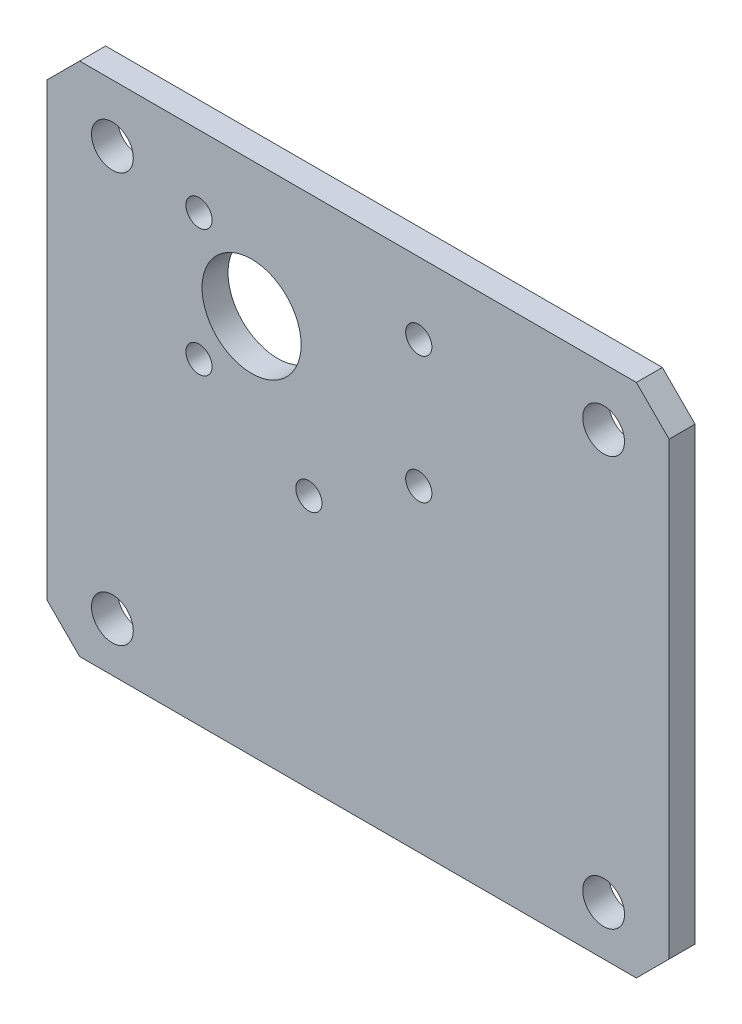
ISO-10303-21;
HEADER;
FILE_DESCRIPTION(('STEP AP214'),'2;1');
FILE_NAME('part.step','',(''),(''),'','','');
FILE_SCHEMA(('AUTOMOTIVE_DESIGN { 1 0 10303 214 1 1 1 1 }'));
ENDSEC;
DATA;
#1=APPLICATION_CONTEXT('core data for automotive mechanical design processes');
#2=APPLICATION_PROTOCOL_DEFINITION('international standard','automotive_design',2000,#1);
#3=PRODUCT_CONTEXT('',#1,'mechanical');
#4=PRODUCT('Part','Part','',(#3));
#5=PRODUCT_RELATED_PRODUCT_CATEGORY('part','',(#4));
#6=PRODUCT_DEFINITION_FORMATION('','',#4);
#7=PRODUCT_DEFINITION_CONTEXT('part definition',#1,'design');
#8=PRODUCT_DEFINITION('design','',#6,#7);
#9=PRODUCT_DEFINITION_SHAPE('','',#8);
#10=(LENGTH_UNIT() NAMED_UNIT(*) SI_UNIT(.MILLI.,.METRE.));
#11=(NAMED_UNIT(*) PLANE_ANGLE_UNIT() SI_UNIT($,.RADIAN.));
#12=(NAMED_UNIT(*) SI_UNIT($,.STERADIAN.) SOLID_ANGLE_UNIT());
#13=UNCERTAINTY_MEASURE_WITH_UNIT(LENGTH_MEASURE(1.E-05),#10,'distance_accuracy_value','');
#14=(GEOMETRIC_REPRESENTATION_CONTEXT(3) GLOBAL_UNCERTAINTY_ASSIGNED_CONTEXT((#13)) GLOBAL_UNIT_ASSIGNED_CONTEXT((#10,
#11,#12)) REPRESENTATION_CONTEXT('',''));
#15=CARTESIAN_POINT('',(0.,0.,0.));
#16=DIRECTION('',(0.,0.,1.));
#17=DIRECTION('',(1.,0.,0.));
#18=AXIS2_PLACEMENT_3D('',#15,#16,#17);
#19=CARTESIAN_POINT('',(0.,0.,3.175));
#20=DIRECTION('',(0.,0.,1.));
#21=DIRECTION('',(1.,0.,0.));
#22=AXIS2_PLACEMENT_3D('',#19,#20,#21);
#23=PLANE('',#22);
#24=CARTESIAN_POINT('',(-24.,9.50000001000001,3.175));
#25=DIRECTION('',(0.,0.,1.));
#26=DIRECTION('',(1.,0.,0.));
#27=AXIS2_PLACEMENT_3D('',#24,#25,#26);
#28=CIRCLE('',#27,2.55269999999999);
#29=CARTESIAN_POINT('',(-21.4473,9.50000001000001,3.175));
#30=VERTEX_POINT('',#29);
#31=EDGE_CURVE('E228',#30,#30,#28,.T.);
#32=ORIENTED_EDGE('',*,*,#31,.F.);
#33=EDGE_LOOP('',(#32));
#34=FACE_BOUND('',#33,.T.);
#35=CARTESIAN_POINT('',(36.,9.50000001000001,3.175));
#36=DIRECTION('',(0.,0.,1.));
#37=DIRECTION('',(1.,0.,0.));
#38=AXIS2_PLACEMENT_3D('',#35,#36,#37);
#39=CIRCLE('',#38,2.55269999999999);
#40=CARTESIAN_POINT('',(38.5527,9.50000001000001,3.175));
#41=VERTEX_POINT('',#40);
#42=EDGE_CURVE('E222',#41,#41,#39,.T.);
#43=ORIENTED_EDGE('',*,*,#42,.F.);
#44=EDGE_LOOP('',(#43));
#45=FACE_BOUND('',#44,.T.);
#46=CARTESIAN_POINT('',(36.,-40.49999999,3.175));
#47=DIRECTION('',(0.,0.,1.));
#48=DIRECTION('',(1.,0.,0.));
#49=AXIS2_PLACEMENT_3D('',#46,#47,#48);
#50=CIRCLE('',#49,2.55269999999999);
#51=CARTESIAN_POINT('',(38.5527,-40.49999999,3.175));
#52=VERTEX_POINT('',#51);
#53=EDGE_CURVE('E216',#52,#52,#50,.T.);
#54=ORIENTED_EDGE('',*,*,#53,.F.);
#55=EDGE_LOOP('',(#54));
#56=FACE_BOUND('',#55,.T.);
#57=CARTESIAN_POINT('',(-24.,-40.49999999,3.175));
#58=DIRECTION('',(0.,0.,1.));
#59=DIRECTION('',(1.,0.,0.));
#60=AXIS2_PLACEMENT_3D('',#57,#58,#59);
#61=CIRCLE('',#60,2.55269999999999);
#62=CARTESIAN_POINT('',(-21.4473,-40.49999999,3.175));
#63=VERTEX_POINT('',#62);
#64=EDGE_CURVE('E210',#63,#63,#61,.T.);
#65=ORIENTED_EDGE('',*,*,#64,.F.);
#66=EDGE_LOOP('',(#65));
#67=FACE_BOUND('',#66,.T.);
#68=CARTESIAN_POINT('',(13.4233937586589,-7.74999999999988,3.175));
#69=DIRECTION('',(0.,0.,1.));
#70=DIRECTION('',(1.,0.,0.));
#71=AXIS2_PLACEMENT_3D('',#68,#69,#70);
#72=CIRCLE('',#71,1.6);
#73=CARTESIAN_POINT('',(15.0233937586589,-7.74999999999988,3.175));
#74=VERTEX_POINT('',#73);
#75=EDGE_CURVE('E193',#74,#74,#72,.T.);
#76=ORIENTED_EDGE('',*,*,#75,.F.);
#77=EDGE_LOOP('',(#76));
#78=FACE_BOUND('',#77,.T.);
#79=CARTESIAN_POINT('',(-13.4233937586588,-7.75000000000006,3.175));
#80=DIRECTION('',(0.,0.,1.));
#81=DIRECTION('',(1.,0.,0.));
#82=AXIS2_PLACEMENT_3D('',#79,#80,#81);
#83=CIRCLE('',#82,1.6);
#84=CARTESIAN_POINT('',(-11.8233937586588,-7.75000000000006,3.175));
#85=VERTEX_POINT('',#84);
#86=EDGE_CURVE('E181',#85,#85,#83,.T.);
#87=ORIENTED_EDGE('',*,*,#86,.F.);
#88=EDGE_LOOP('',(#87));
#89=FACE_BOUND('',#88,.T.);
#90=CARTESIAN_POINT('',(-6.99999999999999,0.,3.175));
#91=DIRECTION('',(0.,0.,1.));
#92=DIRECTION('',(1.,0.,0.));
#93=AXIS2_PLACEMENT_3D('',#90,#91,#92);
#94=CIRCLE('',#93,6.05);
#95=CARTESIAN_POINT('',(-0.949999999999993,0.,3.175));
#96=VERTEX_POINT('',#95);
#97=EDGE_CURVE('E164',#96,#96,#94,.T.);
#98=ORIENTED_EDGE('',*,*,#97,.F.);
#99=EDGE_LOOP('',(#98));
#100=FACE_BOUND('',#99,.T.);
#101=DIRECTION('',(1.,0.,0.));
#102=VECTOR('',#101,1.);
#103=CARTESIAN_POINT('',(-32.,-46.4999999899999,3.175));
#104=LINE('',#103,#102);
#105=CARTESIAN_POINT('',(-28.,-46.4999999899999,3.175));
#106=VERTEX_POINT('',#105);
#107=CARTESIAN_POINT('',(40.,-46.4999999899999,3.175));
#108=VERTEX_POINT('',#107);
#109=EDGE_CURVE('E171',#106,#108,#104,.T.);
#110=ORIENTED_EDGE('',*,*,#109,.T.);
#111=DIRECTION('',(-0.707106781186549,-0.707106781186546,0.));
#112=VECTOR('',#111,1.);
#113=CARTESIAN_POINT('',(43.2499999949999,-43.249999995,3.175));
#114=LINE('',#113,#112);
#115=CARTESIAN_POINT('',(44.,-42.4999999899999,3.175));
#116=VERTEX_POINT('',#115);
#117=EDGE_CURVE('E148',#108,#116,#114,.F.);
#118=ORIENTED_EDGE('',*,*,#117,.T.);
#119=DIRECTION('',(0.,1.,0.));
#120=VECTOR('',#119,1.);
#121=CARTESIAN_POINT('',(44.,16.5000000100001,3.175));
#122=LINE('',#121,#120);
#123=CARTESIAN_POINT('',(44.,12.50000001,3.175));
#124=VERTEX_POINT('',#123);
#125=EDGE_CURVE('E118',#116,#124,#122,.T.);
#126=ORIENTED_EDGE('',*,*,#125,.T.);
#127=DIRECTION('',(0.707106781186545,-0.70710678118655,0.));
#128=VECTOR('',#127,1.);
#129=CARTESIAN_POINT('',(28.2500000050002,28.250000005,3.175));
#130=LINE('',#129,#128);
#131=CARTESIAN_POINT('',(40.,16.5000000100001,3.175));
#132=VERTEX_POINT('',#131);
#133=EDGE_CURVE('E55',#124,#132,#130,.F.);
#134=ORIENTED_EDGE('',*,*,#133,.T.);
#135=DIRECTION('',(-1.,0.,0.));
#136=VECTOR('',#135,1.);
#137=CARTESIAN_POINT('',(-32.,16.5000000100001,3.175));
#138=LINE('',#137,#136);
#139=CARTESIAN_POINT('',(-28.,16.5000000100001,3.175));
#140=VERTEX_POINT('',#139);
#141=EDGE_CURVE('E134',#132,#140,#138,.T.);
#142=ORIENTED_EDGE('',*,*,#141,.T.);
#143=DIRECTION('',(0.707106781186549,0.707106781186546,0.));
#144=VECTOR('',#143,1.);
#145=CARTESIAN_POINT('',(-22.250000005,22.250000005,3.175));
#146=LINE('',#145,#144);
#147=CARTESIAN_POINT('',(-32.,12.5000000100001,3.175));
#148=VERTEX_POINT('',#147);
#149=EDGE_CURVE('E143',#140,#148,#146,.F.);
#150=ORIENTED_EDGE('',*,*,#149,.T.);
#151=DIRECTION('',(0.,-1.,0.));
#152=VECTOR('',#151,1.);
#153=CARTESIAN_POINT('',(-32.,16.5000000100001,3.175));
#154=LINE('',#153,#152);
#155=CARTESIAN_POINT('',(-32.,-42.4999999899999,3.175));
#156=VERTEX_POINT('',#155);
#157=EDGE_CURVE('E128',#148,#156,#154,.T.);
#158=ORIENTED_EDGE('',*,*,#157,.T.);
#159=DIRECTION('',(-0.707106781186545,0.70710678118655,0.));
#160=VECTOR('',#159,1.);
#161=CARTESIAN_POINT('',(-37.249999995,-37.2499999949998,3.175));
#162=LINE('',#161,#160);
#163=EDGE_CURVE('E145',#156,#106,#162,.F.);
#164=ORIENTED_EDGE('',*,*,#163,.T.);
#165=EDGE_LOOP('',(#110,#118,#126,#134,#142,#150,#158,#164));
#166=FACE_BOUND('',#165,.T.);
#167=CARTESIAN_POINT('',(-13.4233937586588,7.74999999999997,3.175));
#168=DIRECTION('',(0.,0.,1.));
#169=DIRECTION('',(1.,0.,0.));
#170=AXIS2_PLACEMENT_3D('',#167,#168,#169);
#171=CIRCLE('',#170,1.6);
#172=CARTESIAN_POINT('',(-11.8233937586588,7.74999999999997,3.175));
#173=VERTEX_POINT('',#172);
#174=EDGE_CURVE('E176',#173,#173,#171,.T.);
#175=ORIENTED_EDGE('',*,*,#174,.F.);
#176=EDGE_LOOP('',(#175));
#177=FACE_BOUND('',#176,.T.);
#178=CARTESIAN_POINT('',(0.,-15.5,3.175));
#179=DIRECTION('',(0.,0.,1.));
#180=DIRECTION('',(1.,0.,0.));
#181=AXIS2_PLACEMENT_3D('',#178,#179,#180);
#182=CIRCLE('',#181,1.6);
#183=CARTESIAN_POINT('',(1.6,-15.5,3.175));
#184=VERTEX_POINT('',#183);
#185=EDGE_CURVE('E187',#184,#184,#182,.T.);
#186=ORIENTED_EDGE('',*,*,#185,.F.);
#187=EDGE_LOOP('',(#186));
#188=FACE_BOUND('',#187,.T.);
#189=CARTESIAN_POINT('',(13.4233937586587,7.75000000000016,3.175));
#190=DIRECTION('',(0.,0.,1.));
#191=DIRECTION('',(1.,0.,0.));
#192=AXIS2_PLACEMENT_3D('',#189,#190,#191);
#193=CIRCLE('',#192,1.6);
#194=CARTESIAN_POINT('',(15.0233937586587,7.75000000000016,3.175));
#195=VERTEX_POINT('',#194);
#196=EDGE_CURVE('E199',#195,#195,#193,.T.);
#197=ORIENTED_EDGE('',*,*,#196,.F.);
#198=EDGE_LOOP('',(#197));
#199=FACE_BOUND('',#198,.T.);
#200=ADVANCED_FACE('F33',(#34,#45,#56,#67,#78,#89,#100,#166,#177,#188,#199),#23,.T.);
#201=CARTESIAN_POINT('',(0.,0.,0.));
#202=DIRECTION('',(0.,0.,1.));
#203=DIRECTION('',(1.,0.,0.));
#204=AXIS2_PLACEMENT_3D('',#201,#202,#203);
#205=PLANE('',#204);
#206=CARTESIAN_POINT('',(-24.,9.50000001000001,0.));
#207=DIRECTION('',(0.,0.,1.));
#208=DIRECTION('',(1.,0.,0.));
#209=AXIS2_PLACEMENT_3D('',#206,#207,#208);
#210=CIRCLE('',#209,2.5527);
#211=CARTESIAN_POINT('',(-21.4473,9.50000001000001,0.));
#212=VERTEX_POINT('',#211);
#213=EDGE_CURVE('E225',#212,#212,#210,.T.);
#214=ORIENTED_EDGE('',*,*,#213,.T.);
#215=EDGE_LOOP('',(#214));
#216=FACE_BOUND('',#215,.T.);
#217=CARTESIAN_POINT('',(36.,9.50000001000001,0.));
#218=DIRECTION('',(0.,0.,1.));
#219=DIRECTION('',(1.,0.,0.));
#220=AXIS2_PLACEMENT_3D('',#217,#218,#219);
#221=CIRCLE('',#220,2.5527);
#222=CARTESIAN_POINT('',(38.5527,9.50000001000001,0.));
#223=VERTEX_POINT('',#222);
#224=EDGE_CURVE('E219',#223,#223,#221,.T.);
#225=ORIENTED_EDGE('',*,*,#224,.T.);
#226=EDGE_LOOP('',(#225));
#227=FACE_BOUND('',#226,.T.);
#228=CARTESIAN_POINT('',(36.,-40.49999999,0.));
#229=DIRECTION('',(0.,0.,1.));
#230=DIRECTION('',(1.,0.,0.));
#231=AXIS2_PLACEMENT_3D('',#228,#229,#230);
#232=CIRCLE('',#231,2.5527);
#233=CARTESIAN_POINT('',(38.5527,-40.49999999,0.));
#234=VERTEX_POINT('',#233);
#235=EDGE_CURVE('E213',#234,#234,#232,.T.);
#236=ORIENTED_EDGE('',*,*,#235,.T.);
#237=EDGE_LOOP('',(#236));
#238=FACE_BOUND('',#237,.T.);
#239=CARTESIAN_POINT('',(-24.,-40.49999999,0.));
#240=DIRECTION('',(0.,0.,1.));
#241=DIRECTION('',(1.,0.,0.));
#242=AXIS2_PLACEMENT_3D('',#239,#240,#241);
#243=CIRCLE('',#242,2.5527);
#244=CARTESIAN_POINT('',(-21.4473,-40.49999999,0.));
#245=VERTEX_POINT('',#244);
#246=EDGE_CURVE('E205',#245,#245,#243,.T.);
#247=ORIENTED_EDGE('',*,*,#246,.T.);
#248=EDGE_LOOP('',(#247));
#249=FACE_BOUND('',#248,.T.);
#250=DIRECTION('',(0.,1.,0.));
#251=VECTOR('',#250,1.);
#252=CARTESIAN_POINT('',(44.,16.5000000100001,0.));
#253=LINE('',#252,#251);
#254=CARTESIAN_POINT('',(44.,-42.4999999899999,0.));
#255=VERTEX_POINT('',#254);
#256=CARTESIAN_POINT('',(44.,12.50000001,0.));
#257=VERTEX_POINT('',#256);
#258=EDGE_CURVE('E116',#255,#257,#253,.T.);
#259=ORIENTED_EDGE('',*,*,#258,.F.);
#260=DIRECTION('',(0.707106781186549,0.707106781186546,0.));
#261=VECTOR('',#260,1.);
#262=CARTESIAN_POINT('',(44.,-42.4999999899999,0.));
#263=LINE('',#262,#261);
#264=CARTESIAN_POINT('',(40.,-46.4999999899999,0.));
#265=VERTEX_POINT('',#264);
#266=EDGE_CURVE('E99',#255,#265,#263,.F.);
#267=ORIENTED_EDGE('',*,*,#266,.T.);
#268=DIRECTION('',(1.,0.,0.));
#269=VECTOR('',#268,1.);
#270=CARTESIAN_POINT('',(-32.,-46.4999999899999,0.));
#271=LINE('',#270,#269);
#272=CARTESIAN_POINT('',(-28.,-46.4999999899999,0.));
#273=VERTEX_POINT('',#272);
#274=EDGE_CURVE('E126',#273,#265,#271,.T.);
#275=ORIENTED_EDGE('',*,*,#274,.F.);
#276=DIRECTION('',(0.707106781186545,-0.70710678118655,0.));
#277=VECTOR('',#276,1.);
#278=CARTESIAN_POINT('',(-28.,-46.4999999899999,0.));
#279=LINE('',#278,#277);
#280=CARTESIAN_POINT('',(-32.,-42.4999999899999,0.));
#281=VERTEX_POINT('',#280);
#282=EDGE_CURVE('E137',#273,#281,#279,.F.);
#283=ORIENTED_EDGE('',*,*,#282,.T.);
#284=DIRECTION('',(0.,-1.,0.));
#285=VECTOR('',#284,1.);
#286=CARTESIAN_POINT('',(-32.,16.5000000100001,0.));
#287=LINE('',#286,#285);
#288=CARTESIAN_POINT('',(-32.,12.5000000100001,0.));
#289=VERTEX_POINT('',#288);
#290=EDGE_CURVE('E130',#289,#281,#287,.T.);
#291=ORIENTED_EDGE('',*,*,#290,.F.);
#292=DIRECTION('',(-0.707106781186549,-0.707106781186546,0.));
#293=VECTOR('',#292,1.);
#294=CARTESIAN_POINT('',(-32.,12.5000000100001,0.));
#295=LINE('',#294,#293);
#296=CARTESIAN_POINT('',(-28.,16.5000000100001,0.));
#297=VERTEX_POINT('',#296);
#298=EDGE_CURVE('E119',#289,#297,#295,.F.);
#299=ORIENTED_EDGE('',*,*,#298,.T.);
#300=DIRECTION('',(-1.,0.,0.));
#301=VECTOR('',#300,1.);
#302=CARTESIAN_POINT('',(-32.,16.5000000100001,0.));
#303=LINE('',#302,#301);
#304=CARTESIAN_POINT('',(40.,16.5000000100001,0.));
#305=VERTEX_POINT('',#304);
#306=EDGE_CURVE('E125',#305,#297,#303,.T.);
#307=ORIENTED_EDGE('',*,*,#306,.F.);
#308=DIRECTION('',(-0.707106781186545,0.70710678118655,0.));
#309=VECTOR('',#308,1.);
#310=CARTESIAN_POINT('',(40.,16.5000000100001,0.));
#311=LINE('',#310,#309);
#312=EDGE_CURVE('E110',#305,#257,#311,.F.);
#313=ORIENTED_EDGE('',*,*,#312,.T.);
#314=EDGE_LOOP('',(#259,#267,#275,#283,#291,#299,#307,#313));
#315=FACE_BOUND('',#314,.T.);
#316=CARTESIAN_POINT('',(-6.99999999999999,0.,0.));
#317=DIRECTION('',(0.,0.,1.));
#318=DIRECTION('',(1.,0.,0.));
#319=AXIS2_PLACEMENT_3D('',#316,#317,#318);
#320=CIRCLE('',#319,6.05);
#321=CARTESIAN_POINT('',(-0.949999999999993,0.,0.));
#322=VERTEX_POINT('',#321);
#323=EDGE_CURVE('E166',#322,#322,#320,.T.);
#324=ORIENTED_EDGE('',*,*,#323,.T.);
#325=EDGE_LOOP('',(#324));
#326=FACE_BOUND('',#325,.T.);
#327=CARTESIAN_POINT('',(-13.4233937586588,7.74999999999997,0.));
#328=DIRECTION('',(0.,0.,1.));
#329=DIRECTION('',(1.,0.,0.));
#330=AXIS2_PLACEMENT_3D('',#327,#328,#329);
#331=CIRCLE('',#330,1.6);
#332=CARTESIAN_POINT('',(-11.8233937586588,7.74999999999997,0.));
#333=VERTEX_POINT('',#332);
#334=EDGE_CURVE('E178',#333,#333,#331,.T.);
#335=ORIENTED_EDGE('',*,*,#334,.T.);
#336=EDGE_LOOP('',(#335));
#337=FACE_BOUND('',#336,.T.);
#338=CARTESIAN_POINT('',(-13.4233937586588,-7.75000000000006,0.));
#339=DIRECTION('',(0.,0.,1.));
#340=DIRECTION('',(1.,0.,0.));
#341=AXIS2_PLACEMENT_3D('',#338,#339,#340);
#342=CIRCLE('',#341,1.6);
#343=CARTESIAN_POINT('',(-11.8233937586588,-7.75000000000006,0.));
#344=VERTEX_POINT('',#343);
#345=EDGE_CURVE('E184',#344,#344,#342,.T.);
#346=ORIENTED_EDGE('',*,*,#345,.T.);
#347=EDGE_LOOP('',(#346));
#348=FACE_BOUND('',#347,.T.);
#349=CARTESIAN_POINT('',(0.,-15.5,0.));
#350=DIRECTION('',(0.,0.,1.));
#351=DIRECTION('',(1.,0.,0.));
#352=AXIS2_PLACEMENT_3D('',#349,#350,#351);
#353=CIRCLE('',#352,1.6);
#354=CARTESIAN_POINT('',(1.6,-15.5,0.));
#355=VERTEX_POINT('',#354);
#356=EDGE_CURVE('E190',#355,#355,#353,.T.);
#357=ORIENTED_EDGE('',*,*,#356,.T.);
#358=EDGE_LOOP('',(#357));
#359=FACE_BOUND('',#358,.T.);
#360=CARTESIAN_POINT('',(13.4233937586589,-7.74999999999988,0.));
#361=DIRECTION('',(0.,0.,1.));
#362=DIRECTION('',(1.,0.,0.));
#363=AXIS2_PLACEMENT_3D('',#360,#361,#362);
#364=CIRCLE('',#363,1.6);
#365=CARTESIAN_POINT('',(15.0233937586589,-7.74999999999988,0.));
#366=VERTEX_POINT('',#365);
#367=EDGE_CURVE('E196',#366,#366,#364,.T.);
#368=ORIENTED_EDGE('',*,*,#367,.T.);
#369=EDGE_LOOP('',(#368));
#370=FACE_BOUND('',#369,.T.);
#371=CARTESIAN_POINT('',(13.4233937586587,7.75000000000016,0.));
#372=DIRECTION('',(0.,0.,1.));
#373=DIRECTION('',(1.,0.,0.));
#374=AXIS2_PLACEMENT_3D('',#371,#372,#373);
#375=CIRCLE('',#374,1.6);
#376=CARTESIAN_POINT('',(15.0233937586587,7.75000000000016,0.));
#377=VERTEX_POINT('',#376);
#378=EDGE_CURVE('E202',#377,#377,#375,.T.);
#379=ORIENTED_EDGE('',*,*,#378,.T.);
#380=EDGE_LOOP('',(#379));
#381=FACE_BOUND('',#380,.T.);
#382=ADVANCED_FACE('F122',(#216,#227,#238,#249,#315,#326,#337,#348,#359,#370,#381),#205,.F.);
#383=CARTESIAN_POINT('',(-32.,16.5000000100001,3.175));
#384=DIRECTION('',(1.,0.,0.));
#385=DIRECTION('',(0.,1.,0.));
#386=AXIS2_PLACEMENT_3D('',#383,#384,#385);
#387=PLANE('',#386);
#388=ORIENTED_EDGE('',*,*,#290,.T.);
#389=DIRECTION('',(0.,0.,1.));
#390=VECTOR('',#389,1.);
#391=CARTESIAN_POINT('',(-32.,-42.4999999899999,3.175));
#392=LINE('',#391,#390);
#393=EDGE_CURVE('E11',#281,#156,#392,.T.);
#394=ORIENTED_EDGE('',*,*,#393,.T.);
#395=ORIENTED_EDGE('',*,*,#157,.F.);
#396=DIRECTION('',(0.,0.,-1.));
#397=VECTOR('',#396,1.);
#398=CARTESIAN_POINT('',(-32.,12.5000000100001,3.175));
#399=LINE('',#398,#397);
#400=EDGE_CURVE('E41',#148,#289,#399,.T.);
#401=ORIENTED_EDGE('',*,*,#400,.T.);
#402=EDGE_LOOP('',(#388,#394,#395,#401));
#403=FACE_BOUND('',#402,.T.);
#404=ADVANCED_FACE('F159',(#403),#387,.F.);
#405=CARTESIAN_POINT('',(-32.,-46.4999999899999,3.175));
#406=DIRECTION('',(0.,1.,0.));
#407=DIRECTION('',(0.,0.,1.));
#408=AXIS2_PLACEMENT_3D('',#405,#406,#407);
#409=PLANE('',#408);
#410=ORIENTED_EDGE('',*,*,#274,.T.);
#411=DIRECTION('',(0.,0.,1.));
#412=VECTOR('',#411,1.);
#413=CARTESIAN_POINT('',(40.,-46.4999999899999,3.175));
#414=LINE('',#413,#412);
#415=EDGE_CURVE('E104',#265,#108,#414,.T.);
#416=ORIENTED_EDGE('',*,*,#415,.T.);
#417=ORIENTED_EDGE('',*,*,#109,.F.);
#418=DIRECTION('',(0.,0.,-1.));
#419=VECTOR('',#418,1.);
#420=CARTESIAN_POINT('',(-28.,-46.4999999899999,3.175));
#421=LINE('',#420,#419);
#422=EDGE_CURVE('E109',#106,#273,#421,.T.);
#423=ORIENTED_EDGE('',*,*,#422,.T.);
#424=EDGE_LOOP('',(#410,#416,#417,#423));
#425=FACE_BOUND('',#424,.T.);
#426=ADVANCED_FACE('F269',(#425),#409,.F.);
#427=CARTESIAN_POINT('',(44.,16.5000000100001,3.175));
#428=DIRECTION('',(-1.,0.,0.));
#429=DIRECTION('',(0.,-1.,0.));
#430=AXIS2_PLACEMENT_3D('',#427,#428,#429);
#431=PLANE('',#430);
#432=ORIENTED_EDGE('',*,*,#125,.F.);
#433=DIRECTION('',(0.,0.,-1.));
#434=VECTOR('',#433,1.);
#435=CARTESIAN_POINT('',(44.,-42.4999999899999,3.175));
#436=LINE('',#435,#434);
#437=EDGE_CURVE('E103',#116,#255,#436,.T.);
#438=ORIENTED_EDGE('',*,*,#437,.T.);
#439=ORIENTED_EDGE('',*,*,#258,.T.);
#440=DIRECTION('',(0.,0.,1.));
#441=VECTOR('',#440,1.);
#442=CARTESIAN_POINT('',(44.,12.50000001,3.175));
#443=LINE('',#442,#441);
#444=EDGE_CURVE('E120',#257,#124,#443,.T.);
#445=ORIENTED_EDGE('',*,*,#444,.T.);
#446=EDGE_LOOP('',(#432,#438,#439,#445));
#447=FACE_BOUND('',#446,.T.);
#448=ADVANCED_FACE('F115',(#447),#431,.F.);
#449=CARTESIAN_POINT('',(-32.,16.5000000100001,3.175));
#450=DIRECTION('',(0.,-1.,0.));
#451=DIRECTION('',(0.,0.,-1.));
#452=AXIS2_PLACEMENT_3D('',#449,#450,#451);
#453=PLANE('',#452);
#454=ORIENTED_EDGE('',*,*,#141,.F.);
#455=DIRECTION('',(0.,0.,-1.));
#456=VECTOR('',#455,1.);
#457=CARTESIAN_POINT('',(40.,16.5000000100001,3.175));
#458=LINE('',#457,#456);
#459=EDGE_CURVE('E151',#132,#305,#458,.T.);
#460=ORIENTED_EDGE('',*,*,#459,.T.);
#461=ORIENTED_EDGE('',*,*,#306,.T.);
#462=DIRECTION('',(0.,0.,1.));
#463=VECTOR('',#462,1.);
#464=CARTESIAN_POINT('',(-28.,16.5000000100001,3.175));
#465=LINE('',#464,#463);
#466=EDGE_CURVE('E48',#297,#140,#465,.T.);
#467=ORIENTED_EDGE('',*,*,#466,.T.);
#468=EDGE_LOOP('',(#454,#460,#461,#467));
#469=FACE_BOUND('',#468,.T.);
#470=ADVANCED_FACE('F274',(#469),#453,.F.);
#471=CARTESIAN_POINT('',(-6.99999999999999,0.,3.175));
#472=DIRECTION('',(0.,0.,-1.));
#473=DIRECTION('',(-1.,0.,0.));
#474=AXIS2_PLACEMENT_3D('',#471,#472,#473);
#475=CYLINDRICAL_SURFACE('',#474,6.05);
#476=ORIENTED_EDGE('',*,*,#97,.T.);
#477=EDGE_LOOP('',(#476));
#478=FACE_BOUND('',#477,.T.);
#479=ORIENTED_EDGE('',*,*,#323,.F.);
#480=EDGE_LOOP('',(#479));
#481=FACE_BOUND('',#480,.T.);
#482=ADVANCED_FACE('F277',(#478,#481),#475,.F.);
#483=CARTESIAN_POINT('',(-13.4233937586588,7.74999999999997,3.175));
#484=DIRECTION('',(0.,0.,-1.));
#485=DIRECTION('',(-1.,0.,0.));
#486=AXIS2_PLACEMENT_3D('',#483,#484,#485);
#487=CYLINDRICAL_SURFACE('',#486,1.6);
#488=ORIENTED_EDGE('',*,*,#174,.T.);
#489=EDGE_LOOP('',(#488));
#490=FACE_BOUND('',#489,.T.);
#491=ORIENTED_EDGE('',*,*,#334,.F.);
#492=EDGE_LOOP('',(#491));
#493=FACE_BOUND('',#492,.T.);
#494=ADVANCED_FACE('F324',(#490,#493),#487,.F.);
#495=CARTESIAN_POINT('',(-13.4233937586588,-7.75000000000006,3.175));
#496=DIRECTION('',(0.,0.,-1.));
#497=DIRECTION('',(-1.,0.,0.));
#498=AXIS2_PLACEMENT_3D('',#495,#496,#497);
#499=CYLINDRICAL_SURFACE('',#498,1.6);
#500=ORIENTED_EDGE('',*,*,#86,.T.);
#501=EDGE_LOOP('',(#500));
#502=FACE_BOUND('',#501,.T.);
#503=ORIENTED_EDGE('',*,*,#345,.F.);
#504=EDGE_LOOP('',(#503));
#505=FACE_BOUND('',#504,.T.);
#506=ADVANCED_FACE('F320',(#502,#505),#499,.F.);
#507=CARTESIAN_POINT('',(0.,-15.5,3.175));
#508=DIRECTION('',(0.,0.,-1.));
#509=DIRECTION('',(-1.,0.,0.));
#510=AXIS2_PLACEMENT_3D('',#507,#508,#509);
#511=CYLINDRICAL_SURFACE('',#510,1.6);
#512=ORIENTED_EDGE('',*,*,#185,.T.);
#513=EDGE_LOOP('',(#512));
#514=FACE_BOUND('',#513,.T.);
#515=ORIENTED_EDGE('',*,*,#356,.F.);
#516=EDGE_LOOP('',(#515));
#517=FACE_BOUND('',#516,.T.);
#518=ADVANCED_FACE('F316',(#514,#517),#511,.F.);
#519=CARTESIAN_POINT('',(13.4233937586589,-7.74999999999988,3.175));
#520=DIRECTION('',(0.,0.,-1.));
#521=DIRECTION('',(-1.,0.,0.));
#522=AXIS2_PLACEMENT_3D('',#519,#520,#521);
#523=CYLINDRICAL_SURFACE('',#522,1.6);
#524=ORIENTED_EDGE('',*,*,#75,.T.);
#525=EDGE_LOOP('',(#524));
#526=FACE_BOUND('',#525,.T.);
#527=ORIENTED_EDGE('',*,*,#367,.F.);
#528=EDGE_LOOP('',(#527));
#529=FACE_BOUND('',#528,.T.);
#530=ADVANCED_FACE('F259',(#526,#529),#523,.F.);
#531=CARTESIAN_POINT('',(13.4233937586587,7.75000000000016,3.175));
#532=DIRECTION('',(0.,0.,-1.));
#533=DIRECTION('',(-1.,0.,0.));
#534=AXIS2_PLACEMENT_3D('',#531,#532,#533);
#535=CYLINDRICAL_SURFACE('',#534,1.6);
#536=ORIENTED_EDGE('',*,*,#196,.T.);
#537=EDGE_LOOP('',(#536));
#538=FACE_BOUND('',#537,.T.);
#539=ORIENTED_EDGE('',*,*,#378,.F.);
#540=EDGE_LOOP('',(#539));
#541=FACE_BOUND('',#540,.T.);
#542=ADVANCED_FACE('F256',(#538,#541),#535,.F.);
#543=CARTESIAN_POINT('',(44.,-42.4999999899999,3.175));
#544=DIRECTION('',(-0.707106781186546,0.707106781186549,0.));
#545=DIRECTION('',(0.,0.,-1.));
#546=AXIS2_PLACEMENT_3D('',#543,#544,#545);
#547=PLANE('',#546);
#548=ORIENTED_EDGE('',*,*,#117,.F.);
#549=ORIENTED_EDGE('',*,*,#415,.F.);
#550=ORIENTED_EDGE('',*,*,#266,.F.);
#551=ORIENTED_EDGE('',*,*,#437,.F.);
#552=EDGE_LOOP('',(#548,#549,#550,#551));
#553=FACE_BOUND('',#552,.T.);
#554=ADVANCED_FACE('F102',(#553),#547,.F.);
#555=CARTESIAN_POINT('',(40.,16.5000000100001,3.175));
#556=DIRECTION('',(-0.70710678118655,-0.707106781186545,0.));
#557=DIRECTION('',(0.,0.,-1.));
#558=AXIS2_PLACEMENT_3D('',#555,#556,#557);
#559=PLANE('',#558);
#560=ORIENTED_EDGE('',*,*,#133,.F.);
#561=ORIENTED_EDGE('',*,*,#444,.F.);
#562=ORIENTED_EDGE('',*,*,#312,.F.);
#563=ORIENTED_EDGE('',*,*,#459,.F.);
#564=EDGE_LOOP('',(#560,#561,#562,#563));
#565=FACE_BOUND('',#564,.T.);
#566=ADVANCED_FACE('F285',(#565),#559,.F.);
#567=CARTESIAN_POINT('',(-28.,-46.4999999899999,3.175));
#568=DIRECTION('',(0.70710678118655,0.707106781186545,0.));
#569=DIRECTION('',(0.,0.,-1.));
#570=AXIS2_PLACEMENT_3D('',#567,#568,#569);
#571=PLANE('',#570);
#572=ORIENTED_EDGE('',*,*,#163,.F.);
#573=ORIENTED_EDGE('',*,*,#393,.F.);
#574=ORIENTED_EDGE('',*,*,#282,.F.);
#575=ORIENTED_EDGE('',*,*,#422,.F.);
#576=EDGE_LOOP('',(#572,#573,#574,#575));
#577=FACE_BOUND('',#576,.T.);
#578=ADVANCED_FACE('F287',(#577),#571,.F.);
#579=CARTESIAN_POINT('',(-32.,12.5000000100001,3.175));
#580=DIRECTION('',(0.707106781186546,-0.707106781186549,0.));
#581=DIRECTION('',(0.,0.,-1.));
#582=AXIS2_PLACEMENT_3D('',#579,#580,#581);
#583=PLANE('',#582);
#584=ORIENTED_EDGE('',*,*,#149,.F.);
#585=ORIENTED_EDGE('',*,*,#466,.F.);
#586=ORIENTED_EDGE('',*,*,#298,.F.);
#587=ORIENTED_EDGE('',*,*,#400,.F.);
#588=EDGE_LOOP('',(#584,#585,#586,#587));
#589=FACE_BOUND('',#588,.T.);
#590=ADVANCED_FACE('F35',(#589),#583,.F.);
#591=CARTESIAN_POINT('',(-24.,-40.49999999,3.175));
#592=DIRECTION('',(0.,0.,1.));
#593=DIRECTION('',(1.,0.,0.));
#594=AXIS2_PLACEMENT_3D('',#591,#592,#593);
#595=CYLINDRICAL_SURFACE('',#594,2.55269999999999);
#596=ORIENTED_EDGE('',*,*,#246,.F.);
#597=EDGE_LOOP('',(#596));
#598=FACE_BOUND('',#597,.T.);
#599=ORIENTED_EDGE('',*,*,#64,.T.);
#600=EDGE_LOOP('',(#599));
#601=FACE_BOUND('',#600,.T.);
#602=ADVANCED_FACE('F294',(#598,#601),#595,.F.);
#603=CARTESIAN_POINT('',(36.,-40.49999999,3.175));
#604=DIRECTION('',(0.,0.,1.));
#605=DIRECTION('',(1.,0.,0.));
#606=AXIS2_PLACEMENT_3D('',#603,#604,#605);
#607=CYLINDRICAL_SURFACE('',#606,2.55269999999999);
#608=ORIENTED_EDGE('',*,*,#235,.F.);
#609=EDGE_LOOP('',(#608));
#610=FACE_BOUND('',#609,.T.);
#611=ORIENTED_EDGE('',*,*,#53,.T.);
#612=EDGE_LOOP('',(#611));
#613=FACE_BOUND('',#612,.T.);
#614=ADVANCED_FACE('F301',(#610,#613),#607,.F.);
#615=CARTESIAN_POINT('',(36.,9.50000001000001,3.175));
#616=DIRECTION('',(0.,0.,1.));
#617=DIRECTION('',(1.,0.,0.));
#618=AXIS2_PLACEMENT_3D('',#615,#616,#617);
#619=CYLINDRICAL_SURFACE('',#618,2.55269999999999);
#620=ORIENTED_EDGE('',*,*,#224,.F.);
#621=EDGE_LOOP('',(#620));
#622=FACE_BOUND('',#621,.T.);
#623=ORIENTED_EDGE('',*,*,#42,.T.);
#624=EDGE_LOOP('',(#623));
#625=FACE_BOUND('',#624,.T.);
#626=ADVANCED_FACE('F307',(#622,#625),#619,.F.);
#627=CARTESIAN_POINT('',(-24.,9.50000001000001,3.175));
#628=DIRECTION('',(0.,0.,1.));
#629=DIRECTION('',(1.,0.,0.));
#630=AXIS2_PLACEMENT_3D('',#627,#628,#629);
#631=CYLINDRICAL_SURFACE('',#630,2.55269999999999);
#632=ORIENTED_EDGE('',*,*,#213,.F.);
#633=EDGE_LOOP('',(#632));
#634=FACE_BOUND('',#633,.T.);
#635=ORIENTED_EDGE('',*,*,#31,.T.);
#636=EDGE_LOOP('',(#635));
#637=FACE_BOUND('',#636,.T.);
#638=ADVANCED_FACE('F232',(#634,#637),#631,.F.);
#639=CLOSED_SHELL('',(#200,#382,#404,#426,#448,#470,#482,#494,#506,#518,#530,#542,#554,#566,
#578,#590,#602,#614,#626,#638));
#640=MANIFOLD_SOLID_BREP('B2',#639);
#641=ADVANCED_BREP_SHAPE_REPRESENTATION('',(#18,#640),#14);
#642=SHAPE_DEFINITION_REPRESENTATION(#9,#641);
ENDSEC;
END-ISO-10303-21;
